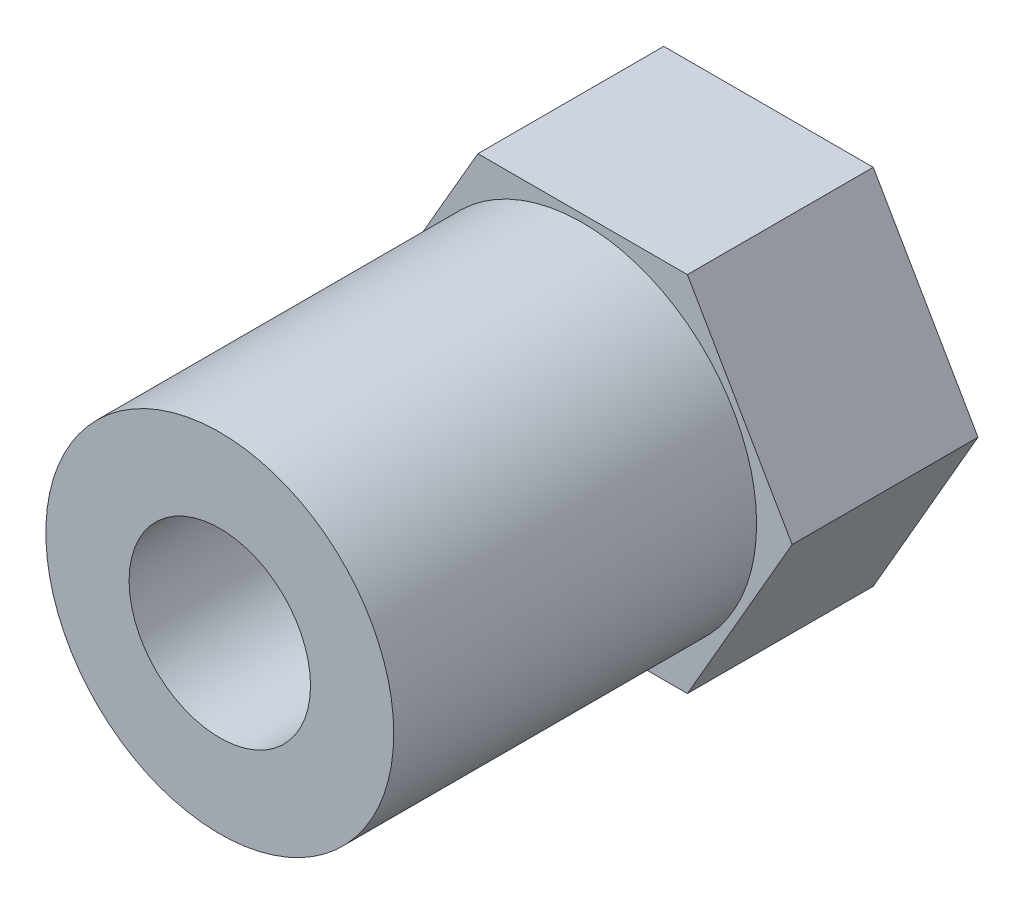
ISO-10303-21;
HEADER;
FILE_DESCRIPTION(('STEP AP214'),'2;1');
FILE_NAME('part.step','',(''),(''),'','','');
FILE_SCHEMA(('AUTOMOTIVE_DESIGN { 1 0 10303 214 1 1 1 1 }'));
ENDSEC;
DATA;
#1=APPLICATION_CONTEXT('core data for automotive mechanical design processes');
#2=APPLICATION_PROTOCOL_DEFINITION('international standard','automotive_design',2000,#1);
#3=PRODUCT_CONTEXT('',#1,'mechanical');
#4=PRODUCT('Part','Part','',(#3));
#5=PRODUCT_RELATED_PRODUCT_CATEGORY('part','',(#4));
#6=PRODUCT_DEFINITION_FORMATION('','',#4);
#7=PRODUCT_DEFINITION_CONTEXT('part definition',#1,'design');
#8=PRODUCT_DEFINITION('design','',#6,#7);
#9=PRODUCT_DEFINITION_SHAPE('','',#8);
#10=(LENGTH_UNIT() NAMED_UNIT(*) SI_UNIT(.MILLI.,.METRE.));
#11=(NAMED_UNIT(*) PLANE_ANGLE_UNIT() SI_UNIT($,.RADIAN.));
#12=(NAMED_UNIT(*) SI_UNIT($,.STERADIAN.) SOLID_ANGLE_UNIT());
#13=UNCERTAINTY_MEASURE_WITH_UNIT(LENGTH_MEASURE(1.E-05),#10,'distance_accuracy_value','');
#14=(GEOMETRIC_REPRESENTATION_CONTEXT(3) GLOBAL_UNCERTAINTY_ASSIGNED_CONTEXT((#13)) GLOBAL_UNIT_ASSIGNED_CONTEXT((#10,
#11,#12)) REPRESENTATION_CONTEXT('',''));
#15=CARTESIAN_POINT('',(0.,0.,0.));
#16=DIRECTION('',(0.,0.,1.));
#17=DIRECTION('',(1.,0.,0.));
#18=AXIS2_PLACEMENT_3D('',#15,#16,#17);
#19=CARTESIAN_POINT('',(0.,0.,6.1468));
#20=DIRECTION('',(0.,0.,1.));
#21=DIRECTION('',(1.,0.,0.));
#22=AXIS2_PLACEMENT_3D('',#19,#20,#21);
#23=PLANE('',#22);
#24=CARTESIAN_POINT('',(0.,0.,6.1468));
#25=DIRECTION('',(0.,0.,1.));
#26=DIRECTION('',(1.,0.,0.));
#27=AXIS2_PLACEMENT_3D('',#24,#25,#26);
#28=CIRCLE('',#27,1.6383);
#29=CARTESIAN_POINT('',(1.6383,0.,6.1468));
#30=VERTEX_POINT('',#29);
#31=EDGE_CURVE('E136',#30,#30,#28,.T.);
#32=ORIENTED_EDGE('',*,*,#31,.F.);
#33=EDGE_LOOP('',(#32));
#34=FACE_BOUND('',#33,.T.);
#35=CARTESIAN_POINT('',(0.,0.,6.1468));
#36=DIRECTION('',(0.,0.,1.));
#37=DIRECTION('',(1.,0.,0.));
#38=AXIS2_PLACEMENT_3D('',#35,#36,#37);
#39=CIRCLE('',#38,3.);
#40=CARTESIAN_POINT('',(3.,0.,6.1468));
#41=VERTEX_POINT('',#40);
#42=EDGE_CURVE('E187',#41,#41,#39,.T.);
#43=ORIENTED_EDGE('',*,*,#42,.T.);
#44=EDGE_LOOP('',(#43));
#45=FACE_BOUND('',#44,.T.);
#46=ADVANCED_FACE('F39',(#34,#45),#23,.T.);
#47=CARTESIAN_POINT('',(0.,0.,6.1468));
#48=DIRECTION('',(0.,0.,1.));
#49=DIRECTION('',(1.,0.,0.));
#50=AXIS2_PLACEMENT_3D('',#47,#48,#49);
#51=CIRCLE('',#50,5.7531);
#52=CARTESIAN_POINT('',(5.7531,0.,6.1468));
#53=VERTEX_POINT('',#52);
#54=EDGE_CURVE('E11',#53,#53,#51,.T.);
#55=ORIENTED_EDGE('',*,*,#54,.F.);
#56=EDGE_LOOP('',(#55));
#57=FACE_BOUND('',#56,.T.);
#58=DIRECTION('',(0.5,0.866025403784439,0.));
#59=VECTOR('',#58,1.);
#60=CARTESIAN_POINT('',(3.46410161513776,-6.,6.1468));
#61=LINE('',#60,#59);
#62=CARTESIAN_POINT('',(3.46410161513776,-6.,6.1468));
#63=VERTEX_POINT('',#62);
#64=CARTESIAN_POINT('',(6.92820323027551,0.,6.1468));
#65=VERTEX_POINT('',#64);
#66=EDGE_CURVE('E148',#63,#65,#61,.T.);
#67=ORIENTED_EDGE('',*,*,#66,.T.);
#68=DIRECTION('',(-0.5,0.866025403784438,0.));
#69=VECTOR('',#68,1.);
#70=CARTESIAN_POINT('',(6.92820323027551,0.,6.1468));
#71=LINE('',#70,#69);
#72=CARTESIAN_POINT('',(3.46410161513775,6.,6.1468));
#73=VERTEX_POINT('',#72);
#74=EDGE_CURVE('E96',#65,#73,#71,.T.);
#75=ORIENTED_EDGE('',*,*,#74,.T.);
#76=DIRECTION('',(-1.,0.,0.));
#77=VECTOR('',#76,1.);
#78=CARTESIAN_POINT('',(3.46410161513775,6.,6.1468));
#79=LINE('',#78,#77);
#80=CARTESIAN_POINT('',(-3.46410161513775,6.,6.1468));
#81=VERTEX_POINT('',#80);
#82=EDGE_CURVE('E109',#73,#81,#79,.T.);
#83=ORIENTED_EDGE('',*,*,#82,.T.);
#84=DIRECTION('',(-0.5,-0.866025403784439,0.));
#85=VECTOR('',#84,1.);
#86=CARTESIAN_POINT('',(-3.46410161513775,6.,6.1468));
#87=LINE('',#86,#85);
#88=CARTESIAN_POINT('',(-6.92820323027551,0.,6.1468));
#89=VERTEX_POINT('',#88);
#90=EDGE_CURVE('E103',#81,#89,#87,.T.);
#91=ORIENTED_EDGE('',*,*,#90,.T.);
#92=DIRECTION('',(0.5,-0.866025403784438,0.));
#93=VECTOR('',#92,1.);
#94=CARTESIAN_POINT('',(-6.92820323027551,0.,6.1468));
#95=LINE('',#94,#93);
#96=CARTESIAN_POINT('',(-3.46410161513775,-6.,6.1468));
#97=VERTEX_POINT('',#96);
#98=EDGE_CURVE('E107',#89,#97,#95,.T.);
#99=ORIENTED_EDGE('',*,*,#98,.T.);
#100=DIRECTION('',(1.,0.,0.));
#101=VECTOR('',#100,1.);
#102=CARTESIAN_POINT('',(-3.46410161513775,-6.,6.1468));
#103=LINE('',#102,#101);
#104=EDGE_CURVE('E58',#97,#63,#103,.T.);
#105=ORIENTED_EDGE('',*,*,#104,.T.);
#106=EDGE_LOOP('',(#67,#75,#83,#91,#99,#105));
#107=FACE_BOUND('',#106,.T.);
#108=ADVANCED_FACE('F105',(#57,#107),#23,.T.);
#109=CARTESIAN_POINT('',(0.,0.,0.));
#110=DIRECTION('',(0.,0.,1.));
#111=DIRECTION('',(1.,0.,0.));
#112=AXIS2_PLACEMENT_3D('',#109,#110,#111);
#113=PLANE('',#112);
#114=DIRECTION('',(0.5,0.866025403784439,0.));
#115=VECTOR('',#114,1.);
#116=CARTESIAN_POINT('',(3.46410161513776,-6.,0.));
#117=LINE('',#116,#115);
#118=CARTESIAN_POINT('',(3.46410161513776,-6.,0.));
#119=VERTEX_POINT('',#118);
#120=CARTESIAN_POINT('',(6.92820323027551,0.,0.));
#121=VERTEX_POINT('',#120);
#122=EDGE_CURVE('E131',#119,#121,#117,.T.);
#123=ORIENTED_EDGE('',*,*,#122,.F.);
#124=DIRECTION('',(1.,0.,0.));
#125=VECTOR('',#124,1.);
#126=CARTESIAN_POINT('',(-3.46410161513775,-6.,0.));
#127=LINE('',#126,#125);
#128=CARTESIAN_POINT('',(-3.46410161513775,-6.,0.));
#129=VERTEX_POINT('',#128);
#130=EDGE_CURVE('E87',#129,#119,#127,.T.);
#131=ORIENTED_EDGE('',*,*,#130,.F.);
#132=DIRECTION('',(0.5,-0.866025403784438,0.));
#133=VECTOR('',#132,1.);
#134=CARTESIAN_POINT('',(-6.92820323027551,0.,0.));
#135=LINE('',#134,#133);
#136=CARTESIAN_POINT('',(-6.92820323027551,0.,0.));
#137=VERTEX_POINT('',#136);
#138=EDGE_CURVE('E81',#137,#129,#135,.T.);
#139=ORIENTED_EDGE('',*,*,#138,.F.);
#140=DIRECTION('',(-0.5,-0.866025403784439,0.));
#141=VECTOR('',#140,1.);
#142=CARTESIAN_POINT('',(-3.46410161513775,6.,0.));
#143=LINE('',#142,#141);
#144=CARTESIAN_POINT('',(-3.46410161513775,6.,0.));
#145=VERTEX_POINT('',#144);
#146=EDGE_CURVE('E118',#145,#137,#143,.T.);
#147=ORIENTED_EDGE('',*,*,#146,.F.);
#148=DIRECTION('',(-1.,0.,0.));
#149=VECTOR('',#148,1.);
#150=CARTESIAN_POINT('',(3.46410161513775,6.,0.));
#151=LINE('',#150,#149);
#152=CARTESIAN_POINT('',(3.46410161513775,6.,0.));
#153=VERTEX_POINT('',#152);
#154=EDGE_CURVE('E139',#153,#145,#151,.T.);
#155=ORIENTED_EDGE('',*,*,#154,.F.);
#156=DIRECTION('',(-0.5,0.866025403784438,0.));
#157=VECTOR('',#156,1.);
#158=CARTESIAN_POINT('',(6.92820323027551,0.,0.));
#159=LINE('',#158,#157);
#160=EDGE_CURVE('E135',#121,#153,#159,.T.);
#161=ORIENTED_EDGE('',*,*,#160,.F.);
#162=EDGE_LOOP('',(#123,#131,#139,#147,#155,#161));
#163=FACE_BOUND('',#162,.T.);
#164=CARTESIAN_POINT('',(0.,0.,0.));
#165=DIRECTION('',(0.,0.,1.));
#166=DIRECTION('',(1.,0.,0.));
#167=AXIS2_PLACEMENT_3D('',#164,#165,#166);
#168=CIRCLE('',#167,1.6383);
#169=CARTESIAN_POINT('',(1.6383,0.,0.));
#170=VERTEX_POINT('',#169);
#171=EDGE_CURVE('E175',#170,#170,#168,.T.);
#172=ORIENTED_EDGE('',*,*,#171,.T.);
#173=EDGE_LOOP('',(#172));
#174=FACE_BOUND('',#173,.T.);
#175=ADVANCED_FACE('F166',(#163,#174),#113,.F.);
#176=CARTESIAN_POINT('',(3.46410161513776,-6.,6.1468));
#177=DIRECTION('',(-0.866025403784439,0.5,0.));
#178=DIRECTION('',(-0.5,-0.866025403784439,0.));
#179=AXIS2_PLACEMENT_3D('',#176,#177,#178);
#180=PLANE('',#179);
#181=ORIENTED_EDGE('',*,*,#122,.T.);
#182=DIRECTION('',(0.,0.,-1.));
#183=VECTOR('',#182,1.);
#184=CARTESIAN_POINT('',(6.92820323027551,0.,6.1468));
#185=LINE('',#184,#183);
#186=EDGE_CURVE('E43',#65,#121,#185,.T.);
#187=ORIENTED_EDGE('',*,*,#186,.F.);
#188=ORIENTED_EDGE('',*,*,#66,.F.);
#189=DIRECTION('',(0.,0.,-1.));
#190=VECTOR('',#189,1.);
#191=CARTESIAN_POINT('',(3.46410161513776,-6.,6.1468));
#192=LINE('',#191,#190);
#193=EDGE_CURVE('E127',#63,#119,#192,.T.);
#194=ORIENTED_EDGE('',*,*,#193,.T.);
#195=EDGE_LOOP('',(#181,#187,#188,#194));
#196=FACE_BOUND('',#195,.T.);
#197=ADVANCED_FACE('F41',(#196),#180,.F.);
#198=CARTESIAN_POINT('',(6.92820323027551,0.,6.1468));
#199=DIRECTION('',(-0.866025403784438,-0.5,0.));
#200=DIRECTION('',(0.5,-0.866025403784439,0.));
#201=AXIS2_PLACEMENT_3D('',#198,#199,#200);
#202=PLANE('',#201);
#203=ORIENTED_EDGE('',*,*,#160,.T.);
#204=DIRECTION('',(0.,0.,-1.));
#205=VECTOR('',#204,1.);
#206=CARTESIAN_POINT('',(3.46410161513775,6.,6.1468));
#207=LINE('',#206,#205);
#208=EDGE_CURVE('E154',#73,#153,#207,.T.);
#209=ORIENTED_EDGE('',*,*,#208,.F.);
#210=ORIENTED_EDGE('',*,*,#74,.F.);
#211=ORIENTED_EDGE('',*,*,#186,.T.);
#212=EDGE_LOOP('',(#203,#209,#210,#211));
#213=FACE_BOUND('',#212,.T.);
#214=ADVANCED_FACE('F161',(#213),#202,.F.);
#215=CARTESIAN_POINT('',(3.46410161513775,6.,6.1468));
#216=DIRECTION('',(0.,-1.,0.));
#217=DIRECTION('',(1.,0.,0.));
#218=AXIS2_PLACEMENT_3D('',#215,#216,#217);
#219=PLANE('',#218);
#220=ORIENTED_EDGE('',*,*,#154,.T.);
#221=DIRECTION('',(0.,0.,-1.));
#222=VECTOR('',#221,1.);
#223=CARTESIAN_POINT('',(-3.46410161513775,6.,6.1468));
#224=LINE('',#223,#222);
#225=EDGE_CURVE('E120',#81,#145,#224,.T.);
#226=ORIENTED_EDGE('',*,*,#225,.F.);
#227=ORIENTED_EDGE('',*,*,#82,.F.);
#228=ORIENTED_EDGE('',*,*,#208,.T.);
#229=EDGE_LOOP('',(#220,#226,#227,#228));
#230=FACE_BOUND('',#229,.T.);
#231=ADVANCED_FACE('F168',(#230),#219,.F.);
#232=CARTESIAN_POINT('',(-3.46410161513775,6.,6.1468));
#233=DIRECTION('',(0.866025403784439,-0.5,0.));
#234=DIRECTION('',(0.5,0.866025403784439,0.));
#235=AXIS2_PLACEMENT_3D('',#232,#233,#234);
#236=PLANE('',#235);
#237=ORIENTED_EDGE('',*,*,#146,.T.);
#238=DIRECTION('',(0.,0.,-1.));
#239=VECTOR('',#238,1.);
#240=CARTESIAN_POINT('',(-6.92820323027551,0.,6.1468));
#241=LINE('',#240,#239);
#242=EDGE_CURVE('E115',#89,#137,#241,.T.);
#243=ORIENTED_EDGE('',*,*,#242,.F.);
#244=ORIENTED_EDGE('',*,*,#90,.F.);
#245=ORIENTED_EDGE('',*,*,#225,.T.);
#246=EDGE_LOOP('',(#237,#243,#244,#245));
#247=FACE_BOUND('',#246,.T.);
#248=ADVANCED_FACE('F116',(#247),#236,.F.);
#249=CARTESIAN_POINT('',(-6.92820323027551,0.,6.1468));
#250=DIRECTION('',(0.866025403784439,0.5,0.));
#251=DIRECTION('',(-0.5,0.866025403784438,0.));
#252=AXIS2_PLACEMENT_3D('',#249,#250,#251);
#253=PLANE('',#252);
#254=ORIENTED_EDGE('',*,*,#138,.T.);
#255=DIRECTION('',(0.,0.,-1.));
#256=VECTOR('',#255,1.);
#257=CARTESIAN_POINT('',(-3.46410161513775,-6.,6.1468));
#258=LINE('',#257,#256);
#259=EDGE_CURVE('E121',#97,#129,#258,.T.);
#260=ORIENTED_EDGE('',*,*,#259,.F.);
#261=ORIENTED_EDGE('',*,*,#98,.F.);
#262=ORIENTED_EDGE('',*,*,#242,.T.);
#263=EDGE_LOOP('',(#254,#260,#261,#262));
#264=FACE_BOUND('',#263,.T.);
#265=ADVANCED_FACE('F123',(#264),#253,.F.);
#266=CARTESIAN_POINT('',(-3.46410161513775,-6.,6.1468));
#267=DIRECTION('',(0.,1.,0.));
#268=DIRECTION('',(0.,0.,1.));
#269=AXIS2_PLACEMENT_3D('',#266,#267,#268);
#270=PLANE('',#269);
#271=ORIENTED_EDGE('',*,*,#130,.T.);
#272=ORIENTED_EDGE('',*,*,#193,.F.);
#273=ORIENTED_EDGE('',*,*,#104,.F.);
#274=ORIENTED_EDGE('',*,*,#259,.T.);
#275=EDGE_LOOP('',(#271,#272,#273,#274));
#276=FACE_BOUND('',#275,.T.);
#277=ADVANCED_FACE('F210',(#276),#270,.F.);
#278=CARTESIAN_POINT('',(0.,0.,6.1468));
#279=DIRECTION('',(0.,0.,-1.));
#280=DIRECTION('',(-1.,0.,0.));
#281=AXIS2_PLACEMENT_3D('',#278,#279,#280);
#282=CYLINDRICAL_SURFACE('',#281,1.6383);
#283=ORIENTED_EDGE('',*,*,#31,.T.);
#284=EDGE_LOOP('',(#283));
#285=FACE_BOUND('',#284,.T.);
#286=ORIENTED_EDGE('',*,*,#171,.F.);
#287=EDGE_LOOP('',(#286));
#288=FACE_BOUND('',#287,.T.);
#289=ADVANCED_FACE('F201',(#285,#288),#282,.F.);
#290=CARTESIAN_POINT('',(0.,0.,18.1468));
#291=DIRECTION('',(0.,0.,1.));
#292=DIRECTION('',(1.,0.,0.));
#293=AXIS2_PLACEMENT_3D('',#290,#291,#292);
#294=PLANE('',#293);
#295=CARTESIAN_POINT('',(0.,0.,18.1468));
#296=DIRECTION('',(0.,0.,1.));
#297=DIRECTION('',(1.,0.,0.));
#298=AXIS2_PLACEMENT_3D('',#295,#296,#297);
#299=CIRCLE('',#298,5.7531);
#300=CARTESIAN_POINT('',(5.7531,0.,18.1468));
#301=VERTEX_POINT('',#300);
#302=EDGE_CURVE('E179',#301,#301,#299,.T.);
#303=ORIENTED_EDGE('',*,*,#302,.T.);
#304=EDGE_LOOP('',(#303));
#305=FACE_BOUND('',#304,.T.);
#306=CARTESIAN_POINT('',(0.,0.,18.1468));
#307=DIRECTION('',(0.,0.,1.));
#308=DIRECTION('',(1.,0.,0.));
#309=AXIS2_PLACEMENT_3D('',#306,#307,#308);
#310=CIRCLE('',#309,3.);
#311=CARTESIAN_POINT('',(3.,0.,18.1468));
#312=VERTEX_POINT('',#311);
#313=EDGE_CURVE('E186',#312,#312,#310,.T.);
#314=ORIENTED_EDGE('',*,*,#313,.F.);
#315=EDGE_LOOP('',(#314));
#316=FACE_BOUND('',#315,.T.);
#317=ADVANCED_FACE('F198',(#305,#316),#294,.T.);
#318=CARTESIAN_POINT('',(0.,0.,18.1468));
#319=DIRECTION('',(0.,0.,-1.));
#320=DIRECTION('',(-1.,0.,0.));
#321=AXIS2_PLACEMENT_3D('',#318,#319,#320);
#322=CYLINDRICAL_SURFACE('',#321,5.7531);
#323=ORIENTED_EDGE('',*,*,#302,.F.);
#324=EDGE_LOOP('',(#323));
#325=FACE_BOUND('',#324,.T.);
#326=ORIENTED_EDGE('',*,*,#54,.T.);
#327=EDGE_LOOP('',(#326));
#328=FACE_BOUND('',#327,.T.);
#329=ADVANCED_FACE('F200',(#325,#328),#322,.T.);
#330=CARTESIAN_POINT('',(0.,0.,18.1468));
#331=DIRECTION('',(0.,0.,-1.));
#332=DIRECTION('',(-1.,0.,0.));
#333=AXIS2_PLACEMENT_3D('',#330,#331,#332);
#334=CYLINDRICAL_SURFACE('',#333,3.);
#335=ORIENTED_EDGE('',*,*,#313,.T.);
#336=EDGE_LOOP('',(#335));
#337=FACE_BOUND('',#336,.T.);
#338=ORIENTED_EDGE('',*,*,#42,.F.);
#339=EDGE_LOOP('',(#338));
#340=FACE_BOUND('',#339,.T.);
#341=ADVANCED_FACE('F195',(#337,#340),#334,.F.);
#342=CLOSED_SHELL('',(#46,#108,#175,#197,#214,#231,#248,#265,#277,#289,#317,#329,#341));
#343=MANIFOLD_SOLID_BREP('B2',#342);
#344=ADVANCED_BREP_SHAPE_REPRESENTATION('',(#18,#343),#14);
#345=SHAPE_DEFINITION_REPRESENTATION(#9,#344);
ENDSEC;
END-ISO-10303-21;
